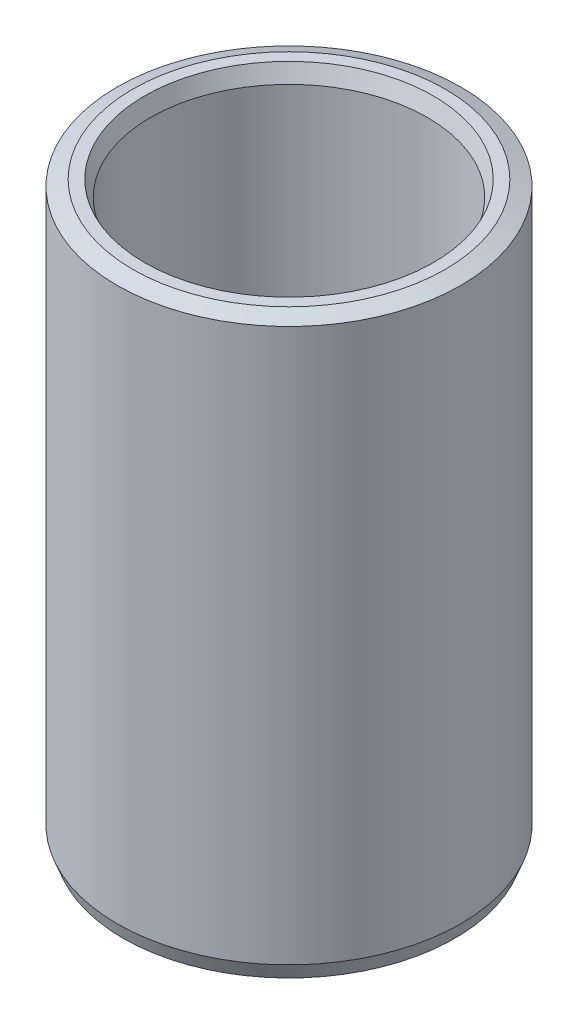
ISO-10303-21;
HEADER;
FILE_DESCRIPTION(('STEP AP214'),'2;1');
FILE_NAME('part.step','',(''),(''),'','','');
FILE_SCHEMA(('AUTOMOTIVE_DESIGN { 1 0 10303 214 1 1 1 1 }'));
ENDSEC;
DATA;
#1=APPLICATION_CONTEXT('core data for automotive mechanical design processes');
#2=APPLICATION_PROTOCOL_DEFINITION('international standard','automotive_design',2000,#1);
#3=PRODUCT_CONTEXT('',#1,'mechanical');
#4=PRODUCT('Part','Part','',(#3));
#5=PRODUCT_RELATED_PRODUCT_CATEGORY('part','',(#4));
#6=PRODUCT_DEFINITION_FORMATION('','',#4);
#7=PRODUCT_DEFINITION_CONTEXT('part definition',#1,'design');
#8=PRODUCT_DEFINITION('design','',#6,#7);
#9=PRODUCT_DEFINITION_SHAPE('','',#8);
#10=(LENGTH_UNIT() NAMED_UNIT(*) SI_UNIT(.MILLI.,.METRE.));
#11=(NAMED_UNIT(*) PLANE_ANGLE_UNIT() SI_UNIT($,.RADIAN.));
#12=(NAMED_UNIT(*) SI_UNIT($,.STERADIAN.) SOLID_ANGLE_UNIT());
#13=UNCERTAINTY_MEASURE_WITH_UNIT(LENGTH_MEASURE(1.E-05),#10,'distance_accuracy_value','');
#14=(GEOMETRIC_REPRESENTATION_CONTEXT(3) GLOBAL_UNCERTAINTY_ASSIGNED_CONTEXT((#13)) GLOBAL_UNIT_ASSIGNED_CONTEXT((#10,
#11,#12)) REPRESENTATION_CONTEXT('',''));
#15=CARTESIAN_POINT('',(0.,0.,0.));
#16=DIRECTION('',(0.,0.,1.));
#17=DIRECTION('',(1.,0.,0.));
#18=AXIS2_PLACEMENT_3D('',#15,#16,#17);
#19=CARTESIAN_POINT('',(0.,167.147831734213,0.));
#20=DIRECTION('',(0.,-1.,0.));
#21=DIRECTION('',(0.,0.,-1.));
#22=AXIS2_PLACEMENT_3D('',#19,#20,#21);
#23=CYLINDRICAL_SURFACE('',#22,50.);
#24=CARTESIAN_POINT('',(0.,4.55357489138547,0.));
#25=DIRECTION('',(0.,1.,0.));
#26=DIRECTION('',(0.,0.,1.));
#27=AXIS2_PLACEMENT_3D('',#24,#25,#26);
#28=CIRCLE('',#27,50.);
#29=CARTESIAN_POINT('',(0.,4.55357489138547,50.));
#30=VERTEX_POINT('',#29);
#31=EDGE_CURVE('E10',#30,#30,#28,.T.);
#32=ORIENTED_EDGE('',*,*,#31,.T.);
#33=EDGE_LOOP('',(#32));
#34=FACE_BOUND('',#33,.T.);
#35=CARTESIAN_POINT('',(0.,165.40069213617,0.));
#36=DIRECTION('',(0.,1.,0.));
#37=DIRECTION('',(0.,0.,1.));
#38=AXIS2_PLACEMENT_3D('',#35,#36,#37);
#39=CIRCLE('',#38,50.);
#40=CARTESIAN_POINT('',(0.,165.40069213617,50.));
#41=VERTEX_POINT('',#40);
#42=EDGE_CURVE('E50',#41,#41,#39,.F.);
#43=ORIENTED_EDGE('',*,*,#42,.T.);
#44=EDGE_LOOP('',(#43));
#45=FACE_BOUND('',#44,.T.);
#46=ADVANCED_FACE('F39',(#34,#45),#23,.T.);
#47=CARTESIAN_POINT('',(0.,167.147831734213,0.));
#48=DIRECTION('',(0.,1.,0.));
#49=DIRECTION('',(0.,0.,1.));
#50=AXIS2_PLACEMENT_3D('',#47,#48,#49);
#51=PLANE('',#50);
#52=CARTESIAN_POINT('',(0.,167.147831734213,0.));
#53=DIRECTION('',(0.,1.,0.));
#54=DIRECTION('',(0.,0.,1.));
#55=AXIS2_PLACEMENT_3D('',#52,#53,#54);
#56=CIRCLE('',#55,42.0253311162715);
#57=CARTESIAN_POINT('',(0.,167.147831734213,42.0253311162715));
#58=VERTEX_POINT('',#57);
#59=EDGE_CURVE('E58',#58,#58,#56,.F.);
#60=ORIENTED_EDGE('',*,*,#59,.T.);
#61=EDGE_LOOP('',(#60));
#62=FACE_BOUND('',#61,.T.);
#63=CARTESIAN_POINT('',(0.,167.147831734213,0.));
#64=DIRECTION('',(0.,1.,0.));
#65=DIRECTION('',(0.,0.,1.));
#66=AXIS2_PLACEMENT_3D('',#63,#64,#65);
#67=CIRCLE('',#66,45.4464251086143);
#68=CARTESIAN_POINT('',(0.,167.147831734213,45.4464251086143));
#69=VERTEX_POINT('',#68);
#70=EDGE_CURVE('E61',#69,#69,#67,.T.);
#71=ORIENTED_EDGE('',*,*,#70,.T.);
#72=EDGE_LOOP('',(#71));
#73=FACE_BOUND('',#72,.T.);
#74=ADVANCED_FACE('F88',(#62,#73),#51,.T.);
#75=CARTESIAN_POINT('',(0.,0.,0.));
#76=DIRECTION('',(0.,1.,0.));
#77=DIRECTION('',(0.,0.,1.));
#78=AXIS2_PLACEMENT_3D('',#75,#76,#77);
#79=PLANE('',#78);
#80=CARTESIAN_POINT('',(0.,0.,0.));
#81=DIRECTION('',(0.,1.,0.));
#82=DIRECTION('',(0.,0.,1.));
#83=AXIS2_PLACEMENT_3D('',#80,#81,#82);
#84=CIRCLE('',#83,44.8317664096147);
#85=CARTESIAN_POINT('',(0.,0.,44.8317664096147));
#86=VERTEX_POINT('',#85);
#87=EDGE_CURVE('E51',#86,#86,#84,.T.);
#88=ORIENTED_EDGE('',*,*,#87,.T.);
#89=EDGE_LOOP('',(#88));
#90=FACE_BOUND('',#89,.T.);
#91=CARTESIAN_POINT('',(0.,0.,0.));
#92=DIRECTION('',(0.,1.,0.));
#93=DIRECTION('',(0.,0.,1.));
#94=AXIS2_PLACEMENT_3D('',#91,#92,#93);
#95=CIRCLE('',#94,48.2528604019577);
#96=CARTESIAN_POINT('',(0.,0.,48.2528604019577));
#97=VERTEX_POINT('',#96);
#98=EDGE_CURVE('E54',#97,#97,#95,.F.);
#99=ORIENTED_EDGE('',*,*,#98,.T.);
#100=EDGE_LOOP('',(#99));
#101=FACE_BOUND('',#100,.T.);
#102=ADVANCED_FACE('F83',(#90,#101),#79,.F.);
#103=CARTESIAN_POINT('',(0.,167.147831734213,0.));
#104=DIRECTION('',(0.,-1.,0.));
#105=DIRECTION('',(0.,0.,-1.));
#106=AXIS2_PLACEMENT_3D('',#103,#104,#105);
#107=CYLINDRICAL_SURFACE('',#106,40.2781915182291);
#108=CARTESIAN_POINT('',(0.,162.594256842827,0.));
#109=DIRECTION('',(0.,1.,0.));
#110=DIRECTION('',(0.,0.,1.));
#111=AXIS2_PLACEMENT_3D('',#108,#109,#110);
#112=CIRCLE('',#111,40.2781915182291);
#113=CARTESIAN_POINT('',(0.,162.594256842827,40.2781915182291));
#114=VERTEX_POINT('',#113);
#115=EDGE_CURVE('E67',#114,#114,#112,.T.);
#116=ORIENTED_EDGE('',*,*,#115,.T.);
#117=EDGE_LOOP('',(#116));
#118=FACE_BOUND('',#117,.T.);
#119=CARTESIAN_POINT('',(0.,1.74713959804243,0.));
#120=DIRECTION('',(0.,1.,0.));
#121=DIRECTION('',(0.,0.,1.));
#122=AXIS2_PLACEMENT_3D('',#119,#120,#121);
#123=CIRCLE('',#122,40.2781915182291);
#124=CARTESIAN_POINT('',(0.,1.74713959804243,40.2781915182291));
#125=VERTEX_POINT('',#124);
#126=EDGE_CURVE('E69',#125,#125,#123,.F.);
#127=ORIENTED_EDGE('',*,*,#126,.T.);
#128=EDGE_LOOP('',(#127));
#129=FACE_BOUND('',#128,.T.);
#130=ADVANCED_FACE('F71',(#118,#129),#107,.F.);
#131=CARTESIAN_POINT('',(0.,162.594256842827,0.));
#132=DIRECTION('',(0.,1.,0.));
#133=DIRECTION('',(0.,0.,1.));
#134=AXIS2_PLACEMENT_3D('',#131,#132,#133);
#135=CONICAL_SURFACE('',#134,40.2781915182291,0.366363324319683);
#136=ORIENTED_EDGE('',*,*,#59,.F.);
#137=EDGE_LOOP('',(#136));
#138=FACE_BOUND('',#137,.T.);
#139=ORIENTED_EDGE('',*,*,#115,.F.);
#140=EDGE_LOOP('',(#139));
#141=FACE_BOUND('',#140,.T.);
#142=ADVANCED_FACE('F77',(#138,#141),#135,.F.);
#143=CARTESIAN_POINT('',(0.,0.,0.));
#144=DIRECTION('',(0.,-1.,0.));
#145=DIRECTION('',(0.,0.,-1.));
#146=AXIS2_PLACEMENT_3D('',#143,#144,#145);
#147=CONICAL_SURFACE('',#146,44.8317664096147,1.20443300247521);
#148=ORIENTED_EDGE('',*,*,#126,.F.);
#149=EDGE_LOOP('',(#148));
#150=FACE_BOUND('',#149,.T.);
#151=ORIENTED_EDGE('',*,*,#87,.F.);
#152=EDGE_LOOP('',(#151));
#153=FACE_BOUND('',#152,.T.);
#154=ADVANCED_FACE('F73',(#150,#153),#147,.F.);
#155=CARTESIAN_POINT('',(0.,4.55357489138547,0.));
#156=DIRECTION('',(0.,1.,0.));
#157=DIRECTION('',(0.,0.,1.));
#158=AXIS2_PLACEMENT_3D('',#155,#156,#157);
#159=CONICAL_SURFACE('',#158,50.,0.366363324319686);
#160=ORIENTED_EDGE('',*,*,#98,.F.);
#161=EDGE_LOOP('',(#160));
#162=FACE_BOUND('',#161,.T.);
#163=ORIENTED_EDGE('',*,*,#31,.F.);
#164=EDGE_LOOP('',(#163));
#165=FACE_BOUND('',#164,.T.);
#166=ADVANCED_FACE('F76',(#162,#165),#159,.T.);
#167=CARTESIAN_POINT('',(0.,167.147831734213,0.));
#168=DIRECTION('',(0.,-1.,0.));
#169=DIRECTION('',(0.,0.,-1.));
#170=AXIS2_PLACEMENT_3D('',#167,#168,#169);
#171=CONICAL_SURFACE('',#170,45.4464251086143,1.20443300247521);
#172=ORIENTED_EDGE('',*,*,#42,.F.);
#173=EDGE_LOOP('',(#172));
#174=FACE_BOUND('',#173,.T.);
#175=ORIENTED_EDGE('',*,*,#70,.F.);
#176=EDGE_LOOP('',(#175));
#177=FACE_BOUND('',#176,.T.);
#178=ADVANCED_FACE('F45',(#174,#177),#171,.T.);
#179=CLOSED_SHELL('',(#46,#74,#102,#130,#142,#154,#166,#178));
#180=MANIFOLD_SOLID_BREP('B2',#179);
#181=ADVANCED_BREP_SHAPE_REPRESENTATION('',(#18,#180),#14);
#182=SHAPE_DEFINITION_REPRESENTATION(#9,#181);
ENDSEC;
END-ISO-10303-21;
